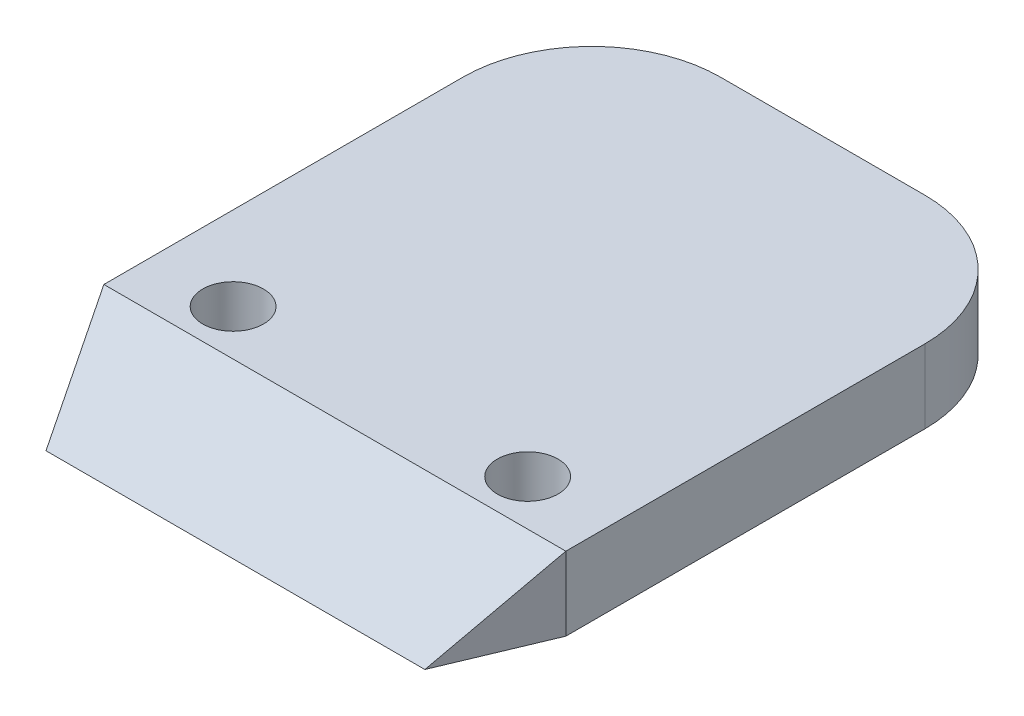
ISO-10303-21;
HEADER;
FILE_DESCRIPTION(('STEP AP214'),'2;1');
FILE_NAME('part.step','',(''),(''),'','','');
FILE_SCHEMA(('AUTOMOTIVE_DESIGN { 1 0 10303 214 1 1 1 1 }'));
ENDSEC;
DATA;
#1=APPLICATION_CONTEXT('core data for automotive mechanical design processes');
#2=APPLICATION_PROTOCOL_DEFINITION('international standard','automotive_design',2000,#1);
#3=PRODUCT_CONTEXT('',#1,'mechanical');
#4=PRODUCT('Part','Part','',(#3));
#5=PRODUCT_RELATED_PRODUCT_CATEGORY('part','',(#4));
#6=PRODUCT_DEFINITION_FORMATION('','',#4);
#7=PRODUCT_DEFINITION_CONTEXT('part definition',#1,'design');
#8=PRODUCT_DEFINITION('design','',#6,#7);
#9=PRODUCT_DEFINITION_SHAPE('','',#8);
#10=(LENGTH_UNIT() NAMED_UNIT(*) SI_UNIT(.MILLI.,.METRE.));
#11=(NAMED_UNIT(*) PLANE_ANGLE_UNIT() SI_UNIT($,.RADIAN.));
#12=(NAMED_UNIT(*) SI_UNIT($,.STERADIAN.) SOLID_ANGLE_UNIT());
#13=UNCERTAINTY_MEASURE_WITH_UNIT(LENGTH_MEASURE(1.E-05),#10,'distance_accuracy_value','');
#14=(GEOMETRIC_REPRESENTATION_CONTEXT(3) GLOBAL_UNCERTAINTY_ASSIGNED_CONTEXT((#13)) GLOBAL_UNIT_ASSIGNED_CONTEXT((#10,
#11,#12)) REPRESENTATION_CONTEXT('',''));
#15=CARTESIAN_POINT('',(0.,0.,0.));
#16=DIRECTION('',(0.,0.,1.));
#17=DIRECTION('',(1.,0.,0.));
#18=AXIS2_PLACEMENT_3D('',#15,#16,#17);
#19=CARTESIAN_POINT('',(-12.5467811820916,-53.9370800671778,23.55));
#20=DIRECTION('',(-1.,0.,0.));
#21=DIRECTION('',(0.,0.,1.));
#22=AXIS2_PLACEMENT_3D('',#19,#20,#21);
#23=PLANE('',#22);
#24=DIRECTION('',(0.,0.,-1.));
#25=VECTOR('',#24,1.);
#26=CARTESIAN_POINT('',(-12.5467811820916,18.25,-26.5));
#27=LINE('',#26,#25);
#28=CARTESIAN_POINT('',(-12.5467811820916,18.25,0.));
#29=VERTEX_POINT('',#28);
#30=CARTESIAN_POINT('',(-12.5467811820916,18.25,-19.5));
#31=VERTEX_POINT('',#30);
#32=EDGE_CURVE('E103',#29,#31,#27,.T.);
#33=ORIENTED_EDGE('',*,*,#32,.F.);
#34=DIRECTION('',(0.,-1.,0.));
#35=VECTOR('',#34,1.);
#36=CARTESIAN_POINT('',(-12.5467811820916,-22.25,0.));
#37=LINE('',#36,#35);
#38=CARTESIAN_POINT('',(-12.5467811820916,22.25,0.));
#39=VERTEX_POINT('',#38);
#40=EDGE_CURVE('E112',#39,#29,#37,.T.);
#41=ORIENTED_EDGE('',*,*,#40,.F.);
#42=DIRECTION('',(0.,0.,1.));
#43=VECTOR('',#42,1.);
#44=CARTESIAN_POINT('',(-12.5467811820916,22.25,0.));
#45=LINE('',#44,#43);
#46=CARTESIAN_POINT('',(-12.5467811820916,22.25,-19.5));
#47=VERTEX_POINT('',#46);
#48=EDGE_CURVE('E216',#47,#39,#45,.T.);
#49=ORIENTED_EDGE('',*,*,#48,.F.);
#50=DIRECTION('',(0.,1.,0.));
#51=VECTOR('',#50,1.);
#52=CARTESIAN_POINT('',(-12.5467811820916,18.25,-19.5));
#53=LINE('',#52,#51);
#54=EDGE_CURVE('E128',#47,#31,#53,.F.);
#55=ORIENTED_EDGE('',*,*,#54,.T.);
#56=EDGE_LOOP('',(#33,#41,#49,#55));
#57=FACE_BOUND('',#56,.T.);
#58=ADVANCED_FACE('F43',(#57),#23,.T.);
#59=CARTESIAN_POINT('',(12.5467811820916,-22.25,0.));
#60=DIRECTION('',(0.922286989349462,0.,0.386505768749582));
#61=DIRECTION('',(0.386505768749582,0.,-0.922286989349462));
#62=AXIS2_PLACEMENT_3D('',#59,#60,#61);
#63=PLANE('',#62);
#64=DIRECTION('',(0.319058627321675,0.564409249584676,-0.761343412209544));
#65=VECTOR('',#64,1.);
#66=CARTESIAN_POINT('',(4.53323718339523,8.07417785475522,19.1220622462834));
#67=LINE('',#66,#65);
#68=CARTESIAN_POINT('',(10.2855947996469,18.25,5.39568345323742));
#69=VERTEX_POINT('',#68);
#70=CARTESIAN_POINT('',(12.5467811820916,22.25,0.));
#71=VERTEX_POINT('',#70);
#72=EDGE_CURVE('E125',#69,#71,#67,.T.);
#73=ORIENTED_EDGE('',*,*,#72,.F.);
#74=DIRECTION('',(0.386505768749582,0.,-0.922286989349462));
#75=VECTOR('',#74,1.);
#76=CARTESIAN_POINT('',(12.5467811820916,18.25,0.));
#77=LINE('',#76,#75);
#78=CARTESIAN_POINT('',(12.5467811820916,18.25,0.));
#79=VERTEX_POINT('',#78);
#80=EDGE_CURVE('E56',#69,#79,#77,.T.);
#81=ORIENTED_EDGE('',*,*,#80,.T.);
#82=DIRECTION('',(0.,-1.,0.));
#83=VECTOR('',#82,1.);
#84=CARTESIAN_POINT('',(12.5467811820916,-22.25,0.));
#85=LINE('',#84,#83);
#86=EDGE_CURVE('E121',#71,#79,#85,.T.);
#87=ORIENTED_EDGE('',*,*,#86,.F.);
#88=EDGE_LOOP('',(#73,#81,#87));
#89=FACE_BOUND('',#88,.T.);
#90=ADVANCED_FACE('F119',(#89),#63,.T.);
#91=CARTESIAN_POINT('',(-0.0254151043009368,-22.25,30.));
#92=DIRECTION('',(-0.922843409478252,0.,0.385175338751789));
#93=DIRECTION('',(0.385175338751789,0.,0.922843409478252));
#94=AXIS2_PLACEMENT_3D('',#91,#92,#93);
#95=PLANE('',#94);
#96=ORIENTED_EDGE('',*,*,#40,.T.);
#97=DIRECTION('',(0.385175338751789,0.,0.922843409478252));
#98=VECTOR('',#97,1.);
#99=CARTESIAN_POINT('',(-0.0254151043009368,18.25,30.));
#100=LINE('',#99,#98);
#101=CARTESIAN_POINT('',(-10.2947369234962,18.25,5.39568345323742));
#102=VERTEX_POINT('',#101);
#103=EDGE_CURVE('E122',#29,#102,#100,.T.);
#104=ORIENTED_EDGE('',*,*,#103,.T.);
#105=DIRECTION('',(0.317899255046787,-0.564641221118904,0.761656323451759));
#106=VECTOR('',#105,1.);
#107=CARTESIAN_POINT('',(3.97023316019826,-7.08692671313878,39.5731925087304));
#108=LINE('',#107,#106);
#109=EDGE_CURVE('E194',#39,#102,#108,.T.);
#110=ORIENTED_EDGE('',*,*,#109,.F.);
#111=EDGE_LOOP('',(#96,#104,#110));
#112=FACE_BOUND('',#111,.T.);
#113=ADVANCED_FACE('F159',(#112),#95,.T.);
#114=CARTESIAN_POINT('',(-12.5467811820916,22.25,0.));
#115=DIRECTION('',(0.,-0.803329441530964,-0.595534892654955));
#116=DIRECTION('',(0.,0.595534892654955,-0.803329441530964));
#117=AXIS2_PLACEMENT_3D('',#114,#115,#116);
#118=PLANE('',#117);
#119=DIRECTION('',(-1.,0.,0.));
#120=VECTOR('',#119,1.);
#121=CARTESIAN_POINT('',(-12.5467811820916,18.25,5.39568345323742));
#122=LINE('',#121,#120);
#123=EDGE_CURVE('E240',#69,#102,#122,.T.);
#124=ORIENTED_EDGE('',*,*,#123,.F.);
#125=ORIENTED_EDGE('',*,*,#72,.T.);
#126=DIRECTION('',(1.,0.,0.));
#127=VECTOR('',#126,1.);
#128=CARTESIAN_POINT('',(-12.5467811820916,22.25,0.));
#129=LINE('',#128,#127);
#130=EDGE_CURVE('E229',#39,#71,#129,.T.);
#131=ORIENTED_EDGE('',*,*,#130,.F.);
#132=ORIENTED_EDGE('',*,*,#109,.T.);
#133=EDGE_LOOP('',(#124,#125,#131,#132));
#134=FACE_BOUND('',#133,.T.);
#135=ADVANCED_FACE('F275',(#134),#118,.F.);
#136=CARTESIAN_POINT('',(12.5467811820916,-53.9370800671778,23.55));
#137=DIRECTION('',(1.,0.,0.));
#138=DIRECTION('',(0.,0.,-1.));
#139=AXIS2_PLACEMENT_3D('',#136,#137,#138);
#140=PLANE('',#139);
#141=ORIENTED_EDGE('',*,*,#86,.T.);
#142=DIRECTION('',(0.,0.,-1.));
#143=VECTOR('',#142,1.);
#144=CARTESIAN_POINT('',(12.5467811820916,18.25,-26.5));
#145=LINE('',#144,#143);
#146=CARTESIAN_POINT('',(12.5467811820916,18.25,-19.5));
#147=VERTEX_POINT('',#146);
#148=EDGE_CURVE('E105',#79,#147,#145,.T.);
#149=ORIENTED_EDGE('',*,*,#148,.T.);
#150=DIRECTION('',(0.,1.,0.));
#151=VECTOR('',#150,1.);
#152=CARTESIAN_POINT('',(12.5467811820916,22.25,-19.5));
#153=LINE('',#152,#151);
#154=CARTESIAN_POINT('',(12.5467811820916,22.25,-19.5));
#155=VERTEX_POINT('',#154);
#156=EDGE_CURVE('E132',#147,#155,#153,.T.);
#157=ORIENTED_EDGE('',*,*,#156,.T.);
#158=DIRECTION('',(0.,0.,1.));
#159=VECTOR('',#158,1.);
#160=CARTESIAN_POINT('',(12.5467811820916,22.25,0.));
#161=LINE('',#160,#159);
#162=EDGE_CURVE('E114',#155,#71,#161,.T.);
#163=ORIENTED_EDGE('',*,*,#162,.T.);
#164=EDGE_LOOP('',(#141,#149,#157,#163));
#165=FACE_BOUND('',#164,.T.);
#166=ADVANCED_FACE('F130',(#165),#140,.T.);
#167=CARTESIAN_POINT('',(64.3396378324059,18.25,-26.5));
#168=DIRECTION('',(0.,1.,0.));
#169=DIRECTION('',(0.,0.,1.));
#170=AXIS2_PLACEMENT_3D('',#167,#168,#169);
#171=PLANE('',#170);
#172=CARTESIAN_POINT('',(0.,18.25,-2.47331654676258));
#173=DIRECTION('',(0.,1.,0.));
#174=DIRECTION('',(0.,0.,1.));
#175=AXIS2_PLACEMENT_3D('',#172,#173,#174);
#176=CIRCLE('',#175,2.25);
#177=CARTESIAN_POINT('',(0.,18.25,-0.223316546762581));
#178=VERTEX_POINT('',#177);
#179=EDGE_CURVE('E139',#178,#178,#176,.F.);
#180=ORIENTED_EDGE('',*,*,#179,.F.);
#181=EDGE_LOOP('',(#180));
#182=FACE_BOUND('',#181,.T.);
#183=CARTESIAN_POINT('',(-8.,18.25,-2.47331654676258));
#184=DIRECTION('',(0.,1.,0.));
#185=DIRECTION('',(0.,0.,1.));
#186=AXIS2_PLACEMENT_3D('',#183,#184,#185);
#187=CIRCLE('',#186,1.65);
#188=CARTESIAN_POINT('',(-8.,18.25,-0.823316546762585));
#189=VERTEX_POINT('',#188);
#190=EDGE_CURVE('E236',#189,#189,#187,.T.);
#191=ORIENTED_EDGE('',*,*,#190,.T.);
#192=EDGE_LOOP('',(#191));
#193=FACE_BOUND('',#192,.T.);
#194=CARTESIAN_POINT('',(8.,18.25,-2.47331654676258));
#195=DIRECTION('',(0.,1.,0.));
#196=DIRECTION('',(0.,0.,1.));
#197=AXIS2_PLACEMENT_3D('',#194,#195,#196);
#198=CIRCLE('',#197,1.65);
#199=CARTESIAN_POINT('',(8.,18.25,-0.823316546762582));
#200=VERTEX_POINT('',#199);
#201=EDGE_CURVE('E242',#200,#200,#198,.T.);
#202=ORIENTED_EDGE('',*,*,#201,.T.);
#203=EDGE_LOOP('',(#202));
#204=FACE_BOUND('',#203,.T.);
#205=DIRECTION('',(-1.,0.,0.));
#206=VECTOR('',#205,1.);
#207=CARTESIAN_POINT('',(64.3396378324059,18.25,-26.5));
#208=LINE('',#207,#206);
#209=CARTESIAN_POINT('',(0.,18.25,-26.5));
#210=VERTEX_POINT('',#209);
#211=CARTESIAN_POINT('',(-5.54678118209162,18.25,-26.5));
#212=VERTEX_POINT('',#211);
#213=EDGE_CURVE('E218',#210,#212,#208,.T.);
#214=ORIENTED_EDGE('',*,*,#213,.F.);
#215=CARTESIAN_POINT('',(0.,18.25,-20.));
#216=DIRECTION('',(0.,1.,0.));
#217=DIRECTION('',(0.,0.,1.));
#218=AXIS2_PLACEMENT_3D('',#215,#216,#217);
#219=CIRCLE('',#218,6.5);
#220=EDGE_CURVE('E226',#210,#210,#219,.T.);
#221=ORIENTED_EDGE('',*,*,#220,.T.);
#222=CARTESIAN_POINT('',(5.54678118209161,18.25,-26.5));
#223=VERTEX_POINT('',#222);
#224=EDGE_CURVE('E217',#223,#210,#208,.T.);
#225=ORIENTED_EDGE('',*,*,#224,.F.);
#226=CARTESIAN_POINT('',(5.54678118209161,18.25,-19.5));
#227=DIRECTION('',(0.,1.,0.));
#228=DIRECTION('',(0.,0.,1.));
#229=AXIS2_PLACEMENT_3D('',#226,#227,#228);
#230=CIRCLE('',#229,7.);
#231=EDGE_CURVE('E110',#223,#147,#230,.F.);
#232=ORIENTED_EDGE('',*,*,#231,.T.);
#233=ORIENTED_EDGE('',*,*,#148,.F.);
#234=ORIENTED_EDGE('',*,*,#80,.F.);
#235=ORIENTED_EDGE('',*,*,#123,.T.);
#236=ORIENTED_EDGE('',*,*,#103,.F.);
#237=ORIENTED_EDGE('',*,*,#32,.T.);
#238=CARTESIAN_POINT('',(-5.54678118209162,18.25,-19.5));
#239=DIRECTION('',(0.,1.,0.));
#240=DIRECTION('',(0.,0.,1.));
#241=AXIS2_PLACEMENT_3D('',#238,#239,#240);
#242=CIRCLE('',#241,7.);
#243=EDGE_CURVE('E199',#31,#212,#242,.F.);
#244=ORIENTED_EDGE('',*,*,#243,.T.);
#245=EDGE_LOOP('',(#214,#221,#225,#232,#233,#234,#235,#236,#237,#244));
#246=FACE_BOUND('',#245,.T.);
#247=ADVANCED_FACE('F108',(#182,#193,#204,#246),#171,.F.);
#248=CARTESIAN_POINT('',(64.3396378324059,22.25,-26.5));
#249=DIRECTION('',(0.,0.,1.));
#250=DIRECTION('',(0.,-1.,0.));
#251=AXIS2_PLACEMENT_3D('',#248,#249,#250);
#252=PLANE('',#251);
#253=ORIENTED_EDGE('',*,*,#224,.T.);
#254=ORIENTED_EDGE('',*,*,#213,.T.);
#255=DIRECTION('',(0.,1.,0.));
#256=VECTOR('',#255,1.);
#257=CARTESIAN_POINT('',(-5.54678118209162,22.25,-26.5));
#258=LINE('',#257,#256);
#259=CARTESIAN_POINT('',(-5.54678118209162,22.25,-26.5));
#260=VERTEX_POINT('',#259);
#261=EDGE_CURVE('E209',#212,#260,#258,.T.);
#262=ORIENTED_EDGE('',*,*,#261,.T.);
#263=DIRECTION('',(-1.,0.,0.));
#264=VECTOR('',#263,1.);
#265=CARTESIAN_POINT('',(64.3396378324059,22.25,-26.5));
#266=LINE('',#265,#264);
#267=CARTESIAN_POINT('',(5.54678118209161,22.25,-26.5));
#268=VERTEX_POINT('',#267);
#269=EDGE_CURVE('E211',#268,#260,#266,.T.);
#270=ORIENTED_EDGE('',*,*,#269,.F.);
#271=DIRECTION('',(0.,1.,0.));
#272=VECTOR('',#271,1.);
#273=CARTESIAN_POINT('',(5.54678118209161,18.25,-26.5));
#274=LINE('',#273,#272);
#275=EDGE_CURVE('E212',#268,#223,#274,.F.);
#276=ORIENTED_EDGE('',*,*,#275,.T.);
#277=EDGE_LOOP('',(#253,#254,#262,#270,#276));
#278=FACE_BOUND('',#277,.T.);
#279=ADVANCED_FACE('F263',(#278),#252,.F.);
#280=CARTESIAN_POINT('',(64.3396378324059,22.25,0.));
#281=DIRECTION('',(0.,-1.,0.));
#282=DIRECTION('',(0.,0.,-1.));
#283=AXIS2_PLACEMENT_3D('',#280,#281,#282);
#284=PLANE('',#283);
#285=CARTESIAN_POINT('',(-8.,22.25,-2.47331654676258));
#286=DIRECTION('',(0.,-1.,0.));
#287=DIRECTION('',(0.,0.,-1.));
#288=AXIS2_PLACEMENT_3D('',#285,#286,#287);
#289=CIRCLE('',#288,1.65);
#290=CARTESIAN_POINT('',(-8.,22.25,-4.12331654676258));
#291=VERTEX_POINT('',#290);
#292=EDGE_CURVE('E245',#291,#291,#289,.T.);
#293=ORIENTED_EDGE('',*,*,#292,.T.);
#294=EDGE_LOOP('',(#293));
#295=FACE_BOUND('',#294,.T.);
#296=CARTESIAN_POINT('',(8.,22.25,-2.47331654676258));
#297=DIRECTION('',(0.,-1.,0.));
#298=DIRECTION('',(0.,0.,-1.));
#299=AXIS2_PLACEMENT_3D('',#296,#297,#298);
#300=CIRCLE('',#299,1.65);
#301=CARTESIAN_POINT('',(8.,22.25,-4.12331654676258));
#302=VERTEX_POINT('',#301);
#303=EDGE_CURVE('E247',#302,#302,#300,.T.);
#304=ORIENTED_EDGE('',*,*,#303,.T.);
#305=EDGE_LOOP('',(#304));
#306=FACE_BOUND('',#305,.T.);
#307=ORIENTED_EDGE('',*,*,#269,.T.);
#308=CARTESIAN_POINT('',(-5.54678118209162,22.25,-19.5));
#309=DIRECTION('',(0.,-1.,0.));
#310=DIRECTION('',(0.,0.,-1.));
#311=AXIS2_PLACEMENT_3D('',#308,#309,#310);
#312=CIRCLE('',#311,7.);
#313=EDGE_CURVE('E203',#260,#47,#312,.F.);
#314=ORIENTED_EDGE('',*,*,#313,.T.);
#315=ORIENTED_EDGE('',*,*,#48,.T.);
#316=ORIENTED_EDGE('',*,*,#130,.T.);
#317=ORIENTED_EDGE('',*,*,#162,.F.);
#318=CARTESIAN_POINT('',(5.54678118209161,22.25,-19.5));
#319=DIRECTION('',(0.,-1.,0.));
#320=DIRECTION('',(0.,0.,-1.));
#321=AXIS2_PLACEMENT_3D('',#318,#319,#320);
#322=CIRCLE('',#321,7.);
#323=EDGE_CURVE('E207',#155,#268,#322,.F.);
#324=ORIENTED_EDGE('',*,*,#323,.T.);
#325=EDGE_LOOP('',(#307,#314,#315,#316,#317,#324));
#326=FACE_BOUND('',#325,.T.);
#327=ADVANCED_FACE('F169',(#295,#306,#326),#284,.F.);
#328=CARTESIAN_POINT('',(-5.54678118209162,22.25,-19.5));
#329=DIRECTION('',(0.,-1.,0.));
#330=DIRECTION('',(0.,0.,-1.));
#331=AXIS2_PLACEMENT_3D('',#328,#329,#330);
#332=CYLINDRICAL_SURFACE('',#331,7.);
#333=ORIENTED_EDGE('',*,*,#243,.F.);
#334=ORIENTED_EDGE('',*,*,#54,.F.);
#335=ORIENTED_EDGE('',*,*,#313,.F.);
#336=ORIENTED_EDGE('',*,*,#261,.F.);
#337=EDGE_LOOP('',(#333,#334,#335,#336));
#338=FACE_BOUND('',#337,.T.);
#339=ADVANCED_FACE('F161',(#338),#332,.T.);
#340=CARTESIAN_POINT('',(5.54678118209161,-53.9370800671778,-19.5000000000001));
#341=DIRECTION('',(0.,-1.,0.));
#342=DIRECTION('',(0.,0.,-1.));
#343=AXIS2_PLACEMENT_3D('',#340,#341,#342);
#344=CYLINDRICAL_SURFACE('',#343,7.);
#345=ORIENTED_EDGE('',*,*,#231,.F.);
#346=ORIENTED_EDGE('',*,*,#275,.F.);
#347=ORIENTED_EDGE('',*,*,#323,.F.);
#348=ORIENTED_EDGE('',*,*,#156,.F.);
#349=EDGE_LOOP('',(#345,#346,#347,#348));
#350=FACE_BOUND('',#349,.T.);
#351=ADVANCED_FACE('F167',(#350),#344,.T.);
#352=CARTESIAN_POINT('',(0.,17.25,-20.));
#353=DIRECTION('',(0.,1.,0.));
#354=DIRECTION('',(0.,0.,1.));
#355=AXIS2_PLACEMENT_3D('',#352,#353,#354);
#356=CYLINDRICAL_SURFACE('',#355,6.5);
#357=CARTESIAN_POINT('',(0.,17.25,-20.));
#358=DIRECTION('',(0.,1.,0.));
#359=DIRECTION('',(0.,0.,1.));
#360=AXIS2_PLACEMENT_3D('',#357,#358,#359);
#361=CIRCLE('',#360,6.5);
#362=CARTESIAN_POINT('',(0.,17.25,-13.5));
#363=VERTEX_POINT('',#362);
#364=EDGE_CURVE('E123',#363,#363,#361,.T.);
#365=ORIENTED_EDGE('',*,*,#364,.T.);
#366=EDGE_LOOP('',(#365));
#367=FACE_BOUND('',#366,.T.);
#368=ORIENTED_EDGE('',*,*,#220,.F.);
#369=EDGE_LOOP('',(#368));
#370=FACE_BOUND('',#369,.T.);
#371=ADVANCED_FACE('F172',(#367,#370),#356,.T.);
#372=CARTESIAN_POINT('',(0.,17.25,-20.));
#373=DIRECTION('',(0.,1.,0.));
#374=DIRECTION('',(0.,0.,1.));
#375=AXIS2_PLACEMENT_3D('',#372,#373,#374);
#376=PLANE('',#375);
#377=CARTESIAN_POINT('',(0.,17.25,-20.));
#378=DIRECTION('',(0.,-1.,0.));
#379=DIRECTION('',(0.,0.,-1.));
#380=AXIS2_PLACEMENT_3D('',#377,#378,#379);
#381=CIRCLE('',#380,6.075);
#382=CARTESIAN_POINT('',(0.,17.25,-26.075));
#383=VERTEX_POINT('',#382);
#384=EDGE_CURVE('E193',#383,#383,#381,.T.);
#385=ORIENTED_EDGE('',*,*,#384,.F.);
#386=EDGE_LOOP('',(#385));
#387=FACE_BOUND('',#386,.T.);
#388=ORIENTED_EDGE('',*,*,#364,.F.);
#389=EDGE_LOOP('',(#388));
#390=FACE_BOUND('',#389,.T.);
#391=ADVANCED_FACE('F283',(#387,#390),#376,.F.);
#392=CARTESIAN_POINT('',(0.,12.25,-20.));
#393=DIRECTION('',(0.,1.,0.));
#394=DIRECTION('',(0.,0.,1.));
#395=AXIS2_PLACEMENT_3D('',#392,#393,#394);
#396=CYLINDRICAL_SURFACE('',#395,6.075);
#397=CARTESIAN_POINT('',(0.,13.25,-20.));
#398=DIRECTION('',(0.,-1.,0.));
#399=DIRECTION('',(0.,0.,-1.));
#400=AXIS2_PLACEMENT_3D('',#397,#398,#399);
#401=CIRCLE('',#400,6.075);
#402=CARTESIAN_POINT('',(0.,13.25,-26.075));
#403=VERTEX_POINT('',#402);
#404=EDGE_CURVE('E133',#403,#403,#401,.F.);
#405=ORIENTED_EDGE('',*,*,#404,.T.);
#406=EDGE_LOOP('',(#405));
#407=FACE_BOUND('',#406,.T.);
#408=ORIENTED_EDGE('',*,*,#384,.T.);
#409=EDGE_LOOP('',(#408));
#410=FACE_BOUND('',#409,.T.);
#411=ADVANCED_FACE('F185',(#407,#410),#396,.T.);
#412=CARTESIAN_POINT('',(0.,12.25,-20.));
#413=DIRECTION('',(0.,-1.,0.));
#414=DIRECTION('',(0.,0.,-1.));
#415=AXIS2_PLACEMENT_3D('',#412,#413,#414);
#416=PLANE('',#415);
#417=CARTESIAN_POINT('',(0.,12.25,-20.));
#418=DIRECTION('',(0.,-1.,0.));
#419=DIRECTION('',(0.,0.,-1.));
#420=AXIS2_PLACEMENT_3D('',#417,#418,#419);
#421=CIRCLE('',#420,5.075);
#422=CARTESIAN_POINT('',(0.,12.25,-25.075));
#423=VERTEX_POINT('',#422);
#424=EDGE_CURVE('E195',#423,#423,#421,.T.);
#425=ORIENTED_EDGE('',*,*,#424,.T.);
#426=EDGE_LOOP('',(#425));
#427=FACE_BOUND('',#426,.T.);
#428=ADVANCED_FACE('F173',(#427),#416,.T.);
#429=CARTESIAN_POINT('',(0.,13.25,-20.));
#430=DIRECTION('',(0.,-1.,0.));
#431=DIRECTION('',(0.,0.,-1.));
#432=AXIS2_PLACEMENT_3D('',#429,#430,#431);
#433=TOROIDAL_SURFACE('',#432,5.075,1.);
#434=ORIENTED_EDGE('',*,*,#404,.F.);
#435=EDGE_LOOP('',(#434));
#436=FACE_BOUND('',#435,.T.);
#437=ORIENTED_EDGE('',*,*,#424,.F.);
#438=EDGE_LOOP('',(#437));
#439=FACE_BOUND('',#438,.T.);
#440=ADVANCED_FACE('F175',(#436,#439),#433,.T.);
#441=CARTESIAN_POINT('',(8.,22.25,-2.47331654676258));
#442=DIRECTION('',(0.,-1.,0.));
#443=DIRECTION('',(0.,0.,-1.));
#444=AXIS2_PLACEMENT_3D('',#441,#442,#443);
#445=CYLINDRICAL_SURFACE('',#444,1.65);
#446=ORIENTED_EDGE('',*,*,#303,.F.);
#447=EDGE_LOOP('',(#446));
#448=FACE_BOUND('',#447,.T.);
#449=ORIENTED_EDGE('',*,*,#201,.F.);
#450=EDGE_LOOP('',(#449));
#451=FACE_BOUND('',#450,.T.);
#452=ADVANCED_FACE('F171',(#448,#451),#445,.F.);
#453=CARTESIAN_POINT('',(-8.,22.25,-2.47331654676258));
#454=DIRECTION('',(0.,-1.,0.));
#455=DIRECTION('',(0.,0.,-1.));
#456=AXIS2_PLACEMENT_3D('',#453,#454,#455);
#457=CYLINDRICAL_SURFACE('',#456,1.65);
#458=ORIENTED_EDGE('',*,*,#292,.F.);
#459=EDGE_LOOP('',(#458));
#460=FACE_BOUND('',#459,.T.);
#461=ORIENTED_EDGE('',*,*,#190,.F.);
#462=EDGE_LOOP('',(#461));
#463=FACE_BOUND('',#462,.T.);
#464=ADVANCED_FACE('F183',(#460,#463),#457,.F.);
#465=CARTESIAN_POINT('',(0.,12.25,-2.47331654676258));
#466=DIRECTION('',(0.,1.,0.));
#467=DIRECTION('',(0.,0.,1.));
#468=AXIS2_PLACEMENT_3D('',#465,#466,#467);
#469=CYLINDRICAL_SURFACE('',#468,2.25);
#470=CARTESIAN_POINT('',(0.,13.25,-2.47331654676258));
#471=DIRECTION('',(0.,-1.,0.));
#472=DIRECTION('',(0.,0.,-1.));
#473=AXIS2_PLACEMENT_3D('',#470,#471,#472);
#474=CIRCLE('',#473,2.25);
#475=CARTESIAN_POINT('',(0.,13.25,-4.72331654676258));
#476=VERTEX_POINT('',#475);
#477=EDGE_CURVE('E11',#476,#476,#474,.F.);
#478=ORIENTED_EDGE('',*,*,#477,.T.);
#479=EDGE_LOOP('',(#478));
#480=FACE_BOUND('',#479,.T.);
#481=ORIENTED_EDGE('',*,*,#179,.T.);
#482=EDGE_LOOP('',(#481));
#483=FACE_BOUND('',#482,.T.);
#484=ADVANCED_FACE('F148',(#480,#483),#469,.T.);
#485=CARTESIAN_POINT('',(0.,12.25,-2.47331654676258));
#486=DIRECTION('',(0.,-1.,0.));
#487=DIRECTION('',(0.,0.,-1.));
#488=AXIS2_PLACEMENT_3D('',#485,#486,#487);
#489=PLANE('',#488);
#490=CARTESIAN_POINT('',(0.,12.25,-2.47331654676258));
#491=DIRECTION('',(0.,-1.,0.));
#492=DIRECTION('',(0.,0.,-1.));
#493=AXIS2_PLACEMENT_3D('',#490,#491,#492);
#494=CIRCLE('',#493,1.25);
#495=CARTESIAN_POINT('',(0.,12.25,-3.72331654676258));
#496=VERTEX_POINT('',#495);
#497=EDGE_CURVE('E55',#496,#496,#494,.T.);
#498=ORIENTED_EDGE('',*,*,#497,.T.);
#499=EDGE_LOOP('',(#498));
#500=FACE_BOUND('',#499,.T.);
#501=ADVANCED_FACE('F144',(#500),#489,.T.);
#502=CARTESIAN_POINT('',(0.,13.25,-2.47331654676258));
#503=DIRECTION('',(0.,-1.,0.));
#504=DIRECTION('',(0.,0.,-1.));
#505=AXIS2_PLACEMENT_3D('',#502,#503,#504);
#506=TOROIDAL_SURFACE('',#505,1.25,1.);
#507=ORIENTED_EDGE('',*,*,#477,.F.);
#508=EDGE_LOOP('',(#507));
#509=FACE_BOUND('',#508,.T.);
#510=ORIENTED_EDGE('',*,*,#497,.F.);
#511=EDGE_LOOP('',(#510));
#512=FACE_BOUND('',#511,.T.);
#513=ADVANCED_FACE('F44',(#509,#512),#506,.T.);
#514=CLOSED_SHELL('',(#58,#90,#113,#135,#166,#247,#279,#327,#339,#351,#371,#391,#411,#428,#440,
#452,#464,#484,#501,#513));
#515=MANIFOLD_SOLID_BREP('B2',#514);
#516=ADVANCED_BREP_SHAPE_REPRESENTATION('',(#18,#515),#14);
#517=SHAPE_DEFINITION_REPRESENTATION(#9,#516);
ENDSEC;
END-ISO-10303-21;
